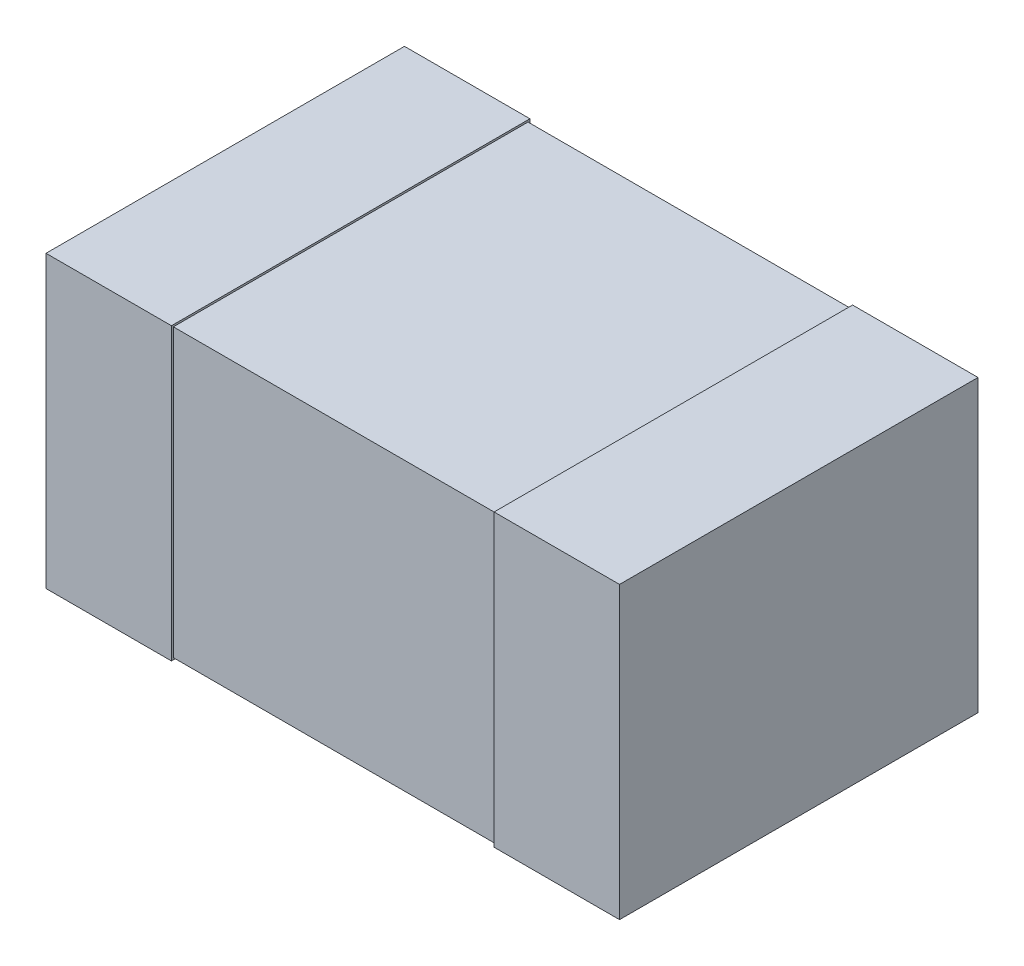
ISO-10303-21;
HEADER;
FILE_DESCRIPTION(('STEP AP214'),'2;1');
FILE_NAME('part.step','',(''),(''),'','','');
FILE_SCHEMA(('AUTOMOTIVE_DESIGN { 1 0 10303 214 1 1 1 1 }'));
ENDSEC;
DATA;
#1=APPLICATION_CONTEXT('core data for automotive mechanical design processes');
#2=APPLICATION_PROTOCOL_DEFINITION('international standard','automotive_design',2000,#1);
#3=PRODUCT_CONTEXT('',#1,'mechanical');
#4=PRODUCT('Part','Part','',(#3));
#5=PRODUCT_RELATED_PRODUCT_CATEGORY('part','',(#4));
#6=PRODUCT_DEFINITION_FORMATION('','',#4);
#7=PRODUCT_DEFINITION_CONTEXT('part definition',#1,'design');
#8=PRODUCT_DEFINITION('design','',#6,#7);
#9=PRODUCT_DEFINITION_SHAPE('','',#8);
#10=(LENGTH_UNIT() NAMED_UNIT(*) SI_UNIT(.MILLI.,.METRE.));
#11=(NAMED_UNIT(*) PLANE_ANGLE_UNIT() SI_UNIT($,.RADIAN.));
#12=(NAMED_UNIT(*) SI_UNIT($,.STERADIAN.) SOLID_ANGLE_UNIT());
#13=UNCERTAINTY_MEASURE_WITH_UNIT(LENGTH_MEASURE(1.E-05),#10,'distance_accuracy_value','');
#14=(GEOMETRIC_REPRESENTATION_CONTEXT(3) GLOBAL_UNCERTAINTY_ASSIGNED_CONTEXT((#13)) GLOBAL_UNIT_ASSIGNED_CONTEXT((#10,
#11,#12)) REPRESENTATION_CONTEXT('',''));
#15=CARTESIAN_POINT('',(0.,0.,0.));
#16=DIRECTION('',(0.,0.,1.));
#17=DIRECTION('',(1.,0.,0.));
#18=AXIS2_PLACEMENT_3D('',#15,#16,#17);
#19=CARTESIAN_POINT('',(0.8,-0.405,0.0762));
#20=DIRECTION('',(1.,0.,0.));
#21=DIRECTION('',(0.,1.,0.));
#22=AXIS2_PLACEMENT_3D('',#19,#20,#21);
#23=PLANE('',#22);
#24=DIRECTION('',(0.,0.,1.));
#25=VECTOR('',#24,1.);
#26=CARTESIAN_POINT('',(0.8,0.405,0.0762));
#27=LINE('',#26,#25);
#28=CARTESIAN_POINT('',(0.8,0.405,0.0762));
#29=VERTEX_POINT('',#28);
#30=CARTESIAN_POINT('',(0.8,0.405,1.0762));
#31=VERTEX_POINT('',#30);
#32=EDGE_CURVE('E148',#29,#31,#27,.T.);
#33=ORIENTED_EDGE('',*,*,#32,.T.);
#34=DIRECTION('',(0.,1.,0.));
#35=VECTOR('',#34,1.);
#36=CARTESIAN_POINT('',(0.8,-0.405,1.0762));
#37=LINE('',#36,#35);
#38=CARTESIAN_POINT('',(0.8,-0.405,1.0762));
#39=VERTEX_POINT('',#38);
#40=EDGE_CURVE('E176',#39,#31,#37,.T.);
#41=ORIENTED_EDGE('',*,*,#40,.F.);
#42=DIRECTION('',(0.,0.,1.));
#43=VECTOR('',#42,1.);
#44=CARTESIAN_POINT('',(0.8,-0.405,0.0762));
#45=LINE('',#44,#43);
#46=CARTESIAN_POINT('',(0.8,-0.405,0.0762));
#47=VERTEX_POINT('',#46);
#48=EDGE_CURVE('E11',#47,#39,#45,.T.);
#49=ORIENTED_EDGE('',*,*,#48,.F.);
#50=DIRECTION('',(0.,1.,0.));
#51=VECTOR('',#50,1.);
#52=CARTESIAN_POINT('',(0.8,-0.405,0.0762));
#53=LINE('',#52,#51);
#54=EDGE_CURVE('E248',#47,#29,#53,.T.);
#55=ORIENTED_EDGE('',*,*,#54,.T.);
#56=EDGE_LOOP('',(#33,#41,#49,#55));
#57=FACE_BOUND('',#56,.T.);
#58=ADVANCED_FACE('F18',(#57),#23,.T.);
#59=CARTESIAN_POINT('',(-0.8,0.405,0.0762));
#60=DIRECTION('',(-1.,0.,0.));
#61=DIRECTION('',(0.,0.,1.));
#62=AXIS2_PLACEMENT_3D('',#59,#60,#61);
#63=PLANE('',#62);
#64=DIRECTION('',(0.,0.,1.));
#65=VECTOR('',#64,1.);
#66=CARTESIAN_POINT('',(-0.8,-0.405,0.0762));
#67=LINE('',#66,#65);
#68=CARTESIAN_POINT('',(-0.8,-0.405,0.0762));
#69=VERTEX_POINT('',#68);
#70=CARTESIAN_POINT('',(-0.8,-0.405,1.0762));
#71=VERTEX_POINT('',#70);
#72=EDGE_CURVE('E29',#69,#71,#67,.T.);
#73=ORIENTED_EDGE('',*,*,#72,.T.);
#74=DIRECTION('',(0.,-1.,0.));
#75=VECTOR('',#74,1.);
#76=CARTESIAN_POINT('',(-0.8,0.405,1.0762));
#77=LINE('',#76,#75);
#78=CARTESIAN_POINT('',(-0.8,0.405,1.0762));
#79=VERTEX_POINT('',#78);
#80=EDGE_CURVE('E139',#79,#71,#77,.T.);
#81=ORIENTED_EDGE('',*,*,#80,.F.);
#82=DIRECTION('',(0.,0.,1.));
#83=VECTOR('',#82,1.);
#84=CARTESIAN_POINT('',(-0.8,0.405,0.0762));
#85=LINE('',#84,#83);
#86=CARTESIAN_POINT('',(-0.8,0.405,0.0762));
#87=VERTEX_POINT('',#86);
#88=EDGE_CURVE('E142',#87,#79,#85,.T.);
#89=ORIENTED_EDGE('',*,*,#88,.F.);
#90=DIRECTION('',(0.,-1.,0.));
#91=VECTOR('',#90,1.);
#92=CARTESIAN_POINT('',(-0.8,0.405,0.0762));
#93=LINE('',#92,#91);
#94=EDGE_CURVE('E227',#87,#69,#93,.T.);
#95=ORIENTED_EDGE('',*,*,#94,.T.);
#96=EDGE_LOOP('',(#73,#81,#89,#95));
#97=FACE_BOUND('',#96,.T.);
#98=ADVANCED_FACE('F140',(#97),#63,.T.);
#99=CARTESIAN_POINT('',(-0.8,-0.405,0.0762));
#100=DIRECTION('',(0.,-1.,0.));
#101=DIRECTION('',(0.,0.,-1.));
#102=AXIS2_PLACEMENT_3D('',#99,#100,#101);
#103=PLANE('',#102);
#104=DIRECTION('',(1.,0.,0.));
#105=VECTOR('',#104,1.);
#106=CARTESIAN_POINT('',(0.45,-0.405,0.0762));
#107=LINE('',#106,#105);
#108=CARTESIAN_POINT('',(0.45,-0.405,0.0762));
#109=VERTEX_POINT('',#108);
#110=EDGE_CURVE('E246',#109,#47,#107,.T.);
#111=ORIENTED_EDGE('',*,*,#110,.T.);
#112=ORIENTED_EDGE('',*,*,#48,.T.);
#113=DIRECTION('',(1.,0.,0.));
#114=VECTOR('',#113,1.);
#115=CARTESIAN_POINT('',(0.45,-0.405,1.0762));
#116=LINE('',#115,#114);
#117=CARTESIAN_POINT('',(0.45,-0.405,1.0762));
#118=VERTEX_POINT('',#117);
#119=EDGE_CURVE('E177',#118,#39,#116,.T.);
#120=ORIENTED_EDGE('',*,*,#119,.F.);
#121=DIRECTION('',(0.,0.,1.));
#122=VECTOR('',#121,1.);
#123=CARTESIAN_POINT('',(0.45,-0.405,0.0762));
#124=LINE('',#123,#122);
#125=EDGE_CURVE('E107',#109,#118,#124,.T.);
#126=ORIENTED_EDGE('',*,*,#125,.F.);
#127=EDGE_LOOP('',(#111,#112,#120,#126));
#128=FACE_BOUND('',#127,.T.);
#129=ADVANCED_FACE('F507',(#128),#103,.T.);
#130=CARTESIAN_POINT('',(-0.8,-0.405,0.0762));
#131=DIRECTION('',(0.,-1.,0.));
#132=DIRECTION('',(0.,0.,-1.));
#133=AXIS2_PLACEMENT_3D('',#130,#131,#132);
#134=PLANE('',#133);
#135=DIRECTION('',(1.,0.,0.));
#136=VECTOR('',#135,1.);
#137=CARTESIAN_POINT('',(-0.8,-0.405,1.0762));
#138=LINE('',#137,#136);
#139=CARTESIAN_POINT('',(-0.45,-0.405,1.0762));
#140=VERTEX_POINT('',#139);
#141=EDGE_CURVE('E147',#71,#140,#138,.T.);
#142=ORIENTED_EDGE('',*,*,#141,.F.);
#143=ORIENTED_EDGE('',*,*,#72,.F.);
#144=DIRECTION('',(1.,0.,0.));
#145=VECTOR('',#144,1.);
#146=CARTESIAN_POINT('',(-0.8,-0.405,0.0762));
#147=LINE('',#146,#145);
#148=CARTESIAN_POINT('',(-0.45,-0.405,0.0762));
#149=VERTEX_POINT('',#148);
#150=EDGE_CURVE('E230',#69,#149,#147,.T.);
#151=ORIENTED_EDGE('',*,*,#150,.T.);
#152=DIRECTION('',(0.,0.,1.));
#153=VECTOR('',#152,1.);
#154=CARTESIAN_POINT('',(-0.45,-0.405,0.0762));
#155=LINE('',#154,#153);
#156=EDGE_CURVE('E181',#149,#140,#155,.T.);
#157=ORIENTED_EDGE('',*,*,#156,.T.);
#158=EDGE_LOOP('',(#142,#143,#151,#157));
#159=FACE_BOUND('',#158,.T.);
#160=ADVANCED_FACE('F501',(#159),#134,.T.);
#161=CARTESIAN_POINT('',(0.,0.,1.0762));
#162=DIRECTION('',(0.,0.,1.));
#163=DIRECTION('',(1.,0.,0.));
#164=AXIS2_PLACEMENT_3D('',#161,#162,#163);
#165=PLANE('',#164);
#166=ORIENTED_EDGE('',*,*,#119,.T.);
#167=ORIENTED_EDGE('',*,*,#40,.T.);
#168=DIRECTION('',(-1.,0.,0.));
#169=VECTOR('',#168,1.);
#170=CARTESIAN_POINT('',(0.8,0.405,1.0762));
#171=LINE('',#170,#169);
#172=CARTESIAN_POINT('',(0.45,0.405,1.0762));
#173=VERTEX_POINT('',#172);
#174=EDGE_CURVE('E155',#31,#173,#171,.T.);
#175=ORIENTED_EDGE('',*,*,#174,.T.);
#176=DIRECTION('',(0.,1.,0.));
#177=VECTOR('',#176,1.);
#178=CARTESIAN_POINT('',(0.45,-0.405,1.0762));
#179=LINE('',#178,#177);
#180=EDGE_CURVE('E170',#118,#173,#179,.T.);
#181=ORIENTED_EDGE('',*,*,#180,.F.);
#182=EDGE_LOOP('',(#166,#167,#175,#181));
#183=FACE_BOUND('',#182,.T.);
#184=ADVANCED_FACE('F506',(#183),#165,.T.);
#185=CARTESIAN_POINT('',(0.,0.,1.0762));
#186=DIRECTION('',(0.,0.,1.));
#187=DIRECTION('',(1.,0.,0.));
#188=AXIS2_PLACEMENT_3D('',#185,#186,#187);
#189=PLANE('',#188);
#190=DIRECTION('',(-1.,0.,0.));
#191=VECTOR('',#190,1.);
#192=CARTESIAN_POINT('',(-0.45,0.405,1.0762));
#193=LINE('',#192,#191);
#194=CARTESIAN_POINT('',(-0.45,0.405,1.0762));
#195=VERTEX_POINT('',#194);
#196=EDGE_CURVE('E119',#195,#79,#193,.T.);
#197=ORIENTED_EDGE('',*,*,#196,.T.);
#198=ORIENTED_EDGE('',*,*,#80,.T.);
#199=ORIENTED_EDGE('',*,*,#141,.T.);
#200=DIRECTION('',(0.,1.,0.));
#201=VECTOR('',#200,1.);
#202=CARTESIAN_POINT('',(-0.45,-0.405,1.0762));
#203=LINE('',#202,#201);
#204=EDGE_CURVE('E152',#140,#195,#203,.T.);
#205=ORIENTED_EDGE('',*,*,#204,.T.);
#206=EDGE_LOOP('',(#197,#198,#199,#205));
#207=FACE_BOUND('',#206,.T.);
#208=ADVANCED_FACE('F150',(#207),#189,.T.);
#209=CARTESIAN_POINT('',(0.8,0.405,0.0762));
#210=DIRECTION('',(0.,1.,0.));
#211=DIRECTION('',(1.,0.,0.));
#212=AXIS2_PLACEMENT_3D('',#209,#210,#211);
#213=PLANE('',#212);
#214=ORIENTED_EDGE('',*,*,#174,.F.);
#215=ORIENTED_EDGE('',*,*,#32,.F.);
#216=DIRECTION('',(-1.,0.,0.));
#217=VECTOR('',#216,1.);
#218=CARTESIAN_POINT('',(0.8,0.405,0.0762));
#219=LINE('',#218,#217);
#220=CARTESIAN_POINT('',(0.45,0.405,0.0762));
#221=VERTEX_POINT('',#220);
#222=EDGE_CURVE('E226',#29,#221,#219,.T.);
#223=ORIENTED_EDGE('',*,*,#222,.T.);
#224=DIRECTION('',(0.,0.,1.));
#225=VECTOR('',#224,1.);
#226=CARTESIAN_POINT('',(0.45,0.405,0.0762));
#227=LINE('',#226,#225);
#228=EDGE_CURVE('E161',#221,#173,#227,.T.);
#229=ORIENTED_EDGE('',*,*,#228,.T.);
#230=EDGE_LOOP('',(#214,#215,#223,#229));
#231=FACE_BOUND('',#230,.T.);
#232=ADVANCED_FACE('F576',(#231),#213,.T.);
#233=CARTESIAN_POINT('',(0.8,0.405,0.0762));
#234=DIRECTION('',(0.,1.,0.));
#235=DIRECTION('',(1.,0.,0.));
#236=AXIS2_PLACEMENT_3D('',#233,#234,#235);
#237=PLANE('',#236);
#238=DIRECTION('',(-1.,0.,0.));
#239=VECTOR('',#238,1.);
#240=CARTESIAN_POINT('',(-0.45,0.405,0.0762));
#241=LINE('',#240,#239);
#242=CARTESIAN_POINT('',(-0.45,0.405,0.0762));
#243=VERTEX_POINT('',#242);
#244=EDGE_CURVE('E22',#243,#87,#241,.T.);
#245=ORIENTED_EDGE('',*,*,#244,.T.);
#246=ORIENTED_EDGE('',*,*,#88,.T.);
#247=ORIENTED_EDGE('',*,*,#196,.F.);
#248=DIRECTION('',(0.,0.,1.));
#249=VECTOR('',#248,1.);
#250=CARTESIAN_POINT('',(-0.45,0.405,0.0762));
#251=LINE('',#250,#249);
#252=EDGE_CURVE('E182',#243,#195,#251,.T.);
#253=ORIENTED_EDGE('',*,*,#252,.F.);
#254=EDGE_LOOP('',(#245,#246,#247,#253));
#255=FACE_BOUND('',#254,.T.);
#256=ADVANCED_FACE('F157',(#255),#237,.T.);
#257=CARTESIAN_POINT('',(0.45,-0.405,0.081534));
#258=DIRECTION('',(1.,0.,0.));
#259=DIRECTION('',(0.,1.,0.));
#260=AXIS2_PLACEMENT_3D('',#257,#258,#259);
#261=PLANE('',#260);
#262=DIRECTION('',(0.,0.,1.));
#263=VECTOR('',#262,1.);
#264=CARTESIAN_POINT('',(0.45,0.399666,0.081534));
#265=LINE('',#264,#263);
#266=CARTESIAN_POINT('',(0.45,0.399666,0.081534));
#267=VERTEX_POINT('',#266);
#268=CARTESIAN_POINT('',(0.45,0.399666,1.070866));
#269=VERTEX_POINT('',#268);
#270=EDGE_CURVE('E174',#267,#269,#265,.T.);
#271=ORIENTED_EDGE('',*,*,#270,.T.);
#272=DIRECTION('',(0.,-1.,0.));
#273=VECTOR('',#272,1.);
#274=CARTESIAN_POINT('',(0.45,0.399666,1.070866));
#275=LINE('',#274,#273);
#276=CARTESIAN_POINT('',(0.45,-0.399666,1.070866));
#277=VERTEX_POINT('',#276);
#278=EDGE_CURVE('E192',#269,#277,#275,.T.);
#279=ORIENTED_EDGE('',*,*,#278,.T.);
#280=DIRECTION('',(0.,0.,-1.));
#281=VECTOR('',#280,1.);
#282=CARTESIAN_POINT('',(0.45,-0.399666,1.070866));
#283=LINE('',#282,#281);
#284=CARTESIAN_POINT('',(0.45,-0.399666,0.081534));
#285=VERTEX_POINT('',#284);
#286=EDGE_CURVE('E197',#277,#285,#283,.T.);
#287=ORIENTED_EDGE('',*,*,#286,.T.);
#288=DIRECTION('',(0.,1.,0.));
#289=VECTOR('',#288,1.);
#290=CARTESIAN_POINT('',(0.45,-0.399666,0.081534));
#291=LINE('',#290,#289);
#292=EDGE_CURVE('E187',#285,#267,#291,.T.);
#293=ORIENTED_EDGE('',*,*,#292,.T.);
#294=EDGE_LOOP('',(#271,#279,#287,#293));
#295=FACE_BOUND('',#294,.T.);
#296=ORIENTED_EDGE('',*,*,#125,.T.);
#297=ORIENTED_EDGE('',*,*,#180,.T.);
#298=ORIENTED_EDGE('',*,*,#228,.F.);
#299=DIRECTION('',(0.,1.,0.));
#300=VECTOR('',#299,1.);
#301=CARTESIAN_POINT('',(0.45,-0.405,0.0762));
#302=LINE('',#301,#300);
#303=EDGE_CURVE('E238',#109,#221,#302,.T.);
#304=ORIENTED_EDGE('',*,*,#303,.F.);
#305=EDGE_LOOP('',(#296,#297,#298,#304));
#306=FACE_BOUND('',#305,.T.);
#307=ADVANCED_FACE('F265',(#295,#306),#261,.F.);
#308=CARTESIAN_POINT('',(-0.45,-0.405,0.081534));
#309=DIRECTION('',(0.,0.,1.));
#310=DIRECTION('',(1.,0.,0.));
#311=AXIS2_PLACEMENT_3D('',#308,#309,#310);
#312=PLANE('',#311);
#313=DIRECTION('',(0.,1.,0.));
#314=VECTOR('',#313,1.);
#315=CARTESIAN_POINT('',(-0.45,-0.399666,0.081534));
#316=LINE('',#315,#314);
#317=CARTESIAN_POINT('',(-0.45,-0.399666,0.081534));
#318=VERTEX_POINT('',#317);
#319=CARTESIAN_POINT('',(-0.45,0.399666,0.081534));
#320=VERTEX_POINT('',#319);
#321=EDGE_CURVE('E203',#318,#320,#316,.T.);
#322=ORIENTED_EDGE('',*,*,#321,.T.);
#323=DIRECTION('',(1.,0.,0.));
#324=VECTOR('',#323,1.);
#325=CARTESIAN_POINT('',(-0.45,0.399666,0.081534));
#326=LINE('',#325,#324);
#327=EDGE_CURVE('E183',#320,#267,#326,.T.);
#328=ORIENTED_EDGE('',*,*,#327,.T.);
#329=ORIENTED_EDGE('',*,*,#292,.F.);
#330=DIRECTION('',(1.,0.,0.));
#331=VECTOR('',#330,1.);
#332=CARTESIAN_POINT('',(-0.45,-0.399666,0.081534));
#333=LINE('',#332,#331);
#334=EDGE_CURVE('E202',#318,#285,#333,.T.);
#335=ORIENTED_EDGE('',*,*,#334,.F.);
#336=EDGE_LOOP('',(#322,#328,#329,#335));
#337=FACE_BOUND('',#336,.T.);
#338=ADVANCED_FACE('F261',(#337),#312,.F.);
#339=CARTESIAN_POINT('',(-0.45,0.399666,0.0762));
#340=DIRECTION('',(0.,-1.,0.));
#341=DIRECTION('',(0.,0.,-1.));
#342=AXIS2_PLACEMENT_3D('',#339,#340,#341);
#343=PLANE('',#342);
#344=DIRECTION('',(0.,0.,1.));
#345=VECTOR('',#344,1.);
#346=CARTESIAN_POINT('',(-0.45,0.399666,0.081534));
#347=LINE('',#346,#345);
#348=CARTESIAN_POINT('',(-0.45,0.399666,1.070866));
#349=VERTEX_POINT('',#348);
#350=EDGE_CURVE('E208',#320,#349,#347,.T.);
#351=ORIENTED_EDGE('',*,*,#350,.T.);
#352=DIRECTION('',(1.,0.,0.));
#353=VECTOR('',#352,1.);
#354=CARTESIAN_POINT('',(-0.45,0.399666,1.070866));
#355=LINE('',#354,#353);
#356=EDGE_CURVE('E188',#349,#269,#355,.T.);
#357=ORIENTED_EDGE('',*,*,#356,.T.);
#358=ORIENTED_EDGE('',*,*,#270,.F.);
#359=ORIENTED_EDGE('',*,*,#327,.F.);
#360=EDGE_LOOP('',(#351,#357,#358,#359));
#361=FACE_BOUND('',#360,.T.);
#362=ADVANCED_FACE('F463',(#361),#343,.F.);
#363=CARTESIAN_POINT('',(-0.45,0.405,1.070866));
#364=DIRECTION('',(0.,0.,-1.));
#365=DIRECTION('',(0.,-1.,0.));
#366=AXIS2_PLACEMENT_3D('',#363,#364,#365);
#367=PLANE('',#366);
#368=DIRECTION('',(0.,-1.,0.));
#369=VECTOR('',#368,1.);
#370=CARTESIAN_POINT('',(-0.45,0.399666,1.070866));
#371=LINE('',#370,#369);
#372=CARTESIAN_POINT('',(-0.45,-0.399666,1.070866));
#373=VERTEX_POINT('',#372);
#374=EDGE_CURVE('E196',#349,#373,#371,.T.);
#375=ORIENTED_EDGE('',*,*,#374,.T.);
#376=DIRECTION('',(1.,0.,0.));
#377=VECTOR('',#376,1.);
#378=CARTESIAN_POINT('',(-0.45,-0.399666,1.070866));
#379=LINE('',#378,#377);
#380=EDGE_CURVE('E201',#373,#277,#379,.T.);
#381=ORIENTED_EDGE('',*,*,#380,.T.);
#382=ORIENTED_EDGE('',*,*,#278,.F.);
#383=ORIENTED_EDGE('',*,*,#356,.F.);
#384=EDGE_LOOP('',(#375,#381,#382,#383));
#385=FACE_BOUND('',#384,.T.);
#386=ADVANCED_FACE('F271',(#385),#367,.F.);
#387=CARTESIAN_POINT('',(-0.45,-0.399666,1.0762));
#388=DIRECTION('',(0.,1.,0.));
#389=DIRECTION('',(1.,0.,0.));
#390=AXIS2_PLACEMENT_3D('',#387,#388,#389);
#391=PLANE('',#390);
#392=DIRECTION('',(0.,0.,-1.));
#393=VECTOR('',#392,1.);
#394=CARTESIAN_POINT('',(-0.45,-0.399666,1.070866));
#395=LINE('',#394,#393);
#396=EDGE_CURVE('E207',#373,#318,#395,.T.);
#397=ORIENTED_EDGE('',*,*,#396,.T.);
#398=ORIENTED_EDGE('',*,*,#334,.T.);
#399=ORIENTED_EDGE('',*,*,#286,.F.);
#400=ORIENTED_EDGE('',*,*,#380,.F.);
#401=EDGE_LOOP('',(#397,#398,#399,#400));
#402=FACE_BOUND('',#401,.T.);
#403=ADVANCED_FACE('F256',(#402),#391,.F.);
#404=CARTESIAN_POINT('',(-0.45,-0.405,0.0762));
#405=DIRECTION('',(-1.,0.,0.));
#406=DIRECTION('',(0.,0.,1.));
#407=AXIS2_PLACEMENT_3D('',#404,#405,#406);
#408=PLANE('',#407);
#409=ORIENTED_EDGE('',*,*,#374,.F.);
#410=ORIENTED_EDGE('',*,*,#350,.F.);
#411=ORIENTED_EDGE('',*,*,#321,.F.);
#412=ORIENTED_EDGE('',*,*,#396,.F.);
#413=EDGE_LOOP('',(#409,#410,#411,#412));
#414=FACE_BOUND('',#413,.T.);
#415=ORIENTED_EDGE('',*,*,#252,.T.);
#416=ORIENTED_EDGE('',*,*,#204,.F.);
#417=ORIENTED_EDGE('',*,*,#156,.F.);
#418=DIRECTION('',(0.,1.,0.));
#419=VECTOR('',#418,1.);
#420=CARTESIAN_POINT('',(-0.45,-0.405,0.0762));
#421=LINE('',#420,#419);
#422=EDGE_CURVE('E222',#149,#243,#421,.T.);
#423=ORIENTED_EDGE('',*,*,#422,.T.);
#424=EDGE_LOOP('',(#415,#416,#417,#423));
#425=FACE_BOUND('',#424,.T.);
#426=ADVANCED_FACE('F478',(#414,#425),#408,.F.);
#427=CARTESIAN_POINT('',(0.,0.,0.0762));
#428=DIRECTION('',(0.,0.,1.));
#429=DIRECTION('',(1.,0.,0.));
#430=AXIS2_PLACEMENT_3D('',#427,#428,#429);
#431=PLANE('',#430);
#432=ORIENTED_EDGE('',*,*,#222,.F.);
#433=ORIENTED_EDGE('',*,*,#54,.F.);
#434=ORIENTED_EDGE('',*,*,#110,.F.);
#435=ORIENTED_EDGE('',*,*,#303,.T.);
#436=EDGE_LOOP('',(#432,#433,#434,#435));
#437=FACE_BOUND('',#436,.T.);
#438=ADVANCED_FACE('F483',(#437),#431,.F.);
#439=CARTESIAN_POINT('',(0.,0.,0.0762));
#440=DIRECTION('',(0.,0.,1.));
#441=DIRECTION('',(1.,0.,0.));
#442=AXIS2_PLACEMENT_3D('',#439,#440,#441);
#443=PLANE('',#442);
#444=ORIENTED_EDGE('',*,*,#150,.F.);
#445=ORIENTED_EDGE('',*,*,#94,.F.);
#446=ORIENTED_EDGE('',*,*,#244,.F.);
#447=ORIENTED_EDGE('',*,*,#422,.F.);
#448=EDGE_LOOP('',(#444,#445,#446,#447));
#449=FACE_BOUND('',#448,.T.);
#450=ADVANCED_FACE('F20',(#449),#443,.F.);
#451=CLOSED_SHELL('',(#58,#98,#129,#160,#184,#208,#232,#256,#307,#338,#362,#386,#403,#426,#438,#450));
#452=MANIFOLD_SOLID_BREP('B1',#451);
#453=ADVANCED_BREP_SHAPE_REPRESENTATION('',(#18,#452),#14);
#454=SHAPE_DEFINITION_REPRESENTATION(#9,#453);
ENDSEC;
END-ISO-10303-21;
